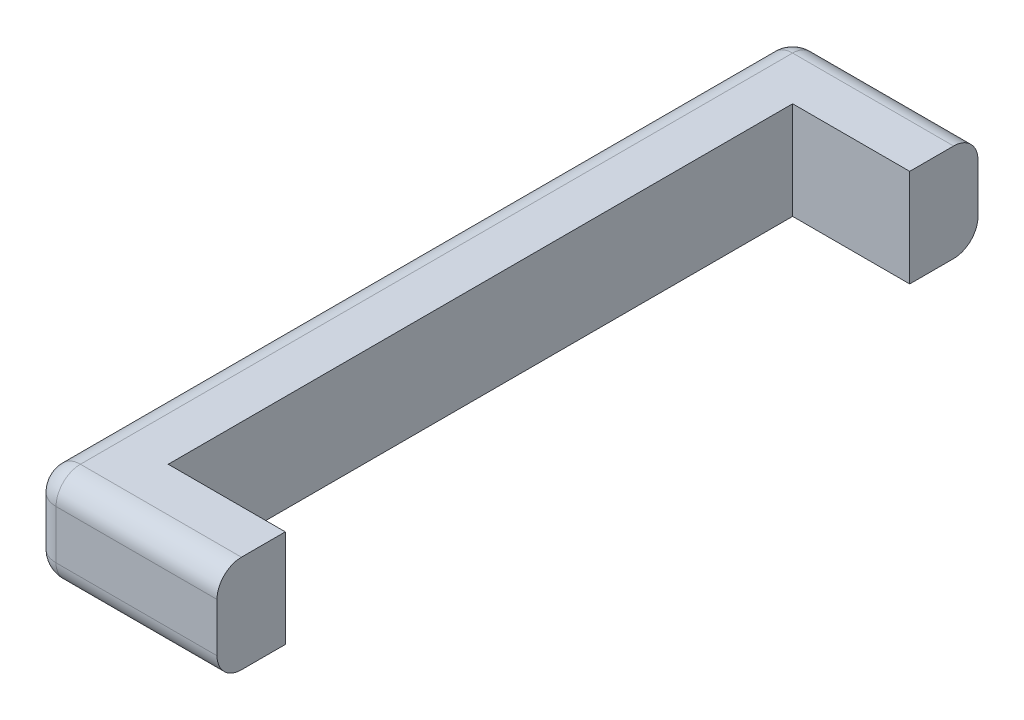
ISO-10303-21;
HEADER;
FILE_DESCRIPTION(('STEP AP214'),'2;1');
FILE_NAME('part.step','',(''),(''),'','','');
FILE_SCHEMA(('AUTOMOTIVE_DESIGN { 1 0 10303 214 1 1 1 1 }'));
ENDSEC;
DATA;
#1=APPLICATION_CONTEXT('core data for automotive mechanical design processes');
#2=APPLICATION_PROTOCOL_DEFINITION('international standard','automotive_design',2000,#1);
#3=PRODUCT_CONTEXT('',#1,'mechanical');
#4=PRODUCT('Part','Part','',(#3));
#5=PRODUCT_RELATED_PRODUCT_CATEGORY('part','',(#4));
#6=PRODUCT_DEFINITION_FORMATION('','',#4);
#7=PRODUCT_DEFINITION_CONTEXT('part definition',#1,'design');
#8=PRODUCT_DEFINITION('design','',#6,#7);
#9=PRODUCT_DEFINITION_SHAPE('','',#8);
#10=(LENGTH_UNIT() NAMED_UNIT(*) SI_UNIT(.MILLI.,.METRE.));
#11=(NAMED_UNIT(*) PLANE_ANGLE_UNIT() SI_UNIT($,.RADIAN.));
#12=(NAMED_UNIT(*) SI_UNIT($,.STERADIAN.) SOLID_ANGLE_UNIT());
#13=UNCERTAINTY_MEASURE_WITH_UNIT(LENGTH_MEASURE(1.E-05),#10,'distance_accuracy_value','');
#14=(GEOMETRIC_REPRESENTATION_CONTEXT(3) GLOBAL_UNCERTAINTY_ASSIGNED_CONTEXT((#13)) GLOBAL_UNIT_ASSIGNED_CONTEXT((#10,
#11,#12)) REPRESENTATION_CONTEXT('',''));
#15=CARTESIAN_POINT('',(0.,0.,0.));
#16=DIRECTION('',(0.,0.,1.));
#17=DIRECTION('',(1.,0.,0.));
#18=AXIS2_PLACEMENT_3D('',#15,#16,#17);
#19=CARTESIAN_POINT('',(1.2490009027033E-13,63.5,-495.3));
#20=DIRECTION('',(1.,0.,0.));
#21=DIRECTION('',(0.,0.,-1.));
#22=AXIS2_PLACEMENT_3D('',#19,#20,#21);
#23=PLANE('',#22);
#24=DIRECTION('',(0.,-1.,0.));
#25=VECTOR('',#24,1.);
#26=CARTESIAN_POINT('',(1.2490009027033E-13,63.5,-463.55));
#27=LINE('',#26,#25);
#28=CARTESIAN_POINT('',(1.2490009027033E-13,31.75,-463.55));
#29=VERTEX_POINT('',#28);
#30=CARTESIAN_POINT('',(1.2490009027033E-13,-31.75,-463.55));
#31=VERTEX_POINT('',#30);
#32=EDGE_CURVE('E196',#29,#31,#27,.T.);
#33=ORIENTED_EDGE('',*,*,#32,.T.);
#34=DIRECTION('',(0.,0.,1.));
#35=VECTOR('',#34,1.);
#36=CARTESIAN_POINT('',(1.2490009027033E-13,-31.75,-495.3));
#37=LINE('',#36,#35);
#38=CARTESIAN_POINT('',(1.2490009027033E-13,-31.75,463.55));
#39=VERTEX_POINT('',#38);
#40=EDGE_CURVE('E11',#31,#39,#37,.T.);
#41=ORIENTED_EDGE('',*,*,#40,.T.);
#42=DIRECTION('',(0.,-1.,0.));
#43=VECTOR('',#42,1.);
#44=CARTESIAN_POINT('',(1.2490009027033E-13,63.5,463.55));
#45=LINE('',#44,#43);
#46=CARTESIAN_POINT('',(1.2490009027033E-13,31.75,463.55));
#47=VERTEX_POINT('',#46);
#48=EDGE_CURVE('E193',#39,#47,#45,.F.);
#49=ORIENTED_EDGE('',*,*,#48,.T.);
#50=DIRECTION('',(0.,0.,1.));
#51=VECTOR('',#50,1.);
#52=CARTESIAN_POINT('',(1.2490009027033E-13,31.75,-463.55));
#53=LINE('',#52,#51);
#54=EDGE_CURVE('E44',#47,#29,#53,.F.);
#55=ORIENTED_EDGE('',*,*,#54,.T.);
#56=EDGE_LOOP('',(#33,#41,#49,#55));
#57=FACE_BOUND('',#56,.T.);
#58=ADVANCED_FACE('F35',(#57),#23,.F.);
#59=CARTESIAN_POINT('',(1.2490009027033E-13,63.5,495.3));
#60=DIRECTION('',(0.,0.,-1.));
#61=DIRECTION('',(-1.,0.,0.));
#62=AXIS2_PLACEMENT_3D('',#59,#60,#61);
#63=PLANE('',#62);
#64=DIRECTION('',(0.,-1.,0.));
#65=VECTOR('',#64,1.);
#66=CARTESIAN_POINT('',(31.7500000000001,63.5,495.3));
#67=LINE('',#66,#65);
#68=CARTESIAN_POINT('',(31.7500000000001,31.75,495.3));
#69=VERTEX_POINT('',#68);
#70=CARTESIAN_POINT('',(31.7500000000001,-31.75,495.3));
#71=VERTEX_POINT('',#70);
#72=EDGE_CURVE('E202',#69,#71,#67,.T.);
#73=ORIENTED_EDGE('',*,*,#72,.T.);
#74=DIRECTION('',(1.,0.,0.));
#75=VECTOR('',#74,1.);
#76=CARTESIAN_POINT('',(1.2490009027033E-13,-31.75,495.3));
#77=LINE('',#76,#75);
#78=CARTESIAN_POINT('',(241.3,-31.75,495.3));
#79=VERTEX_POINT('',#78);
#80=EDGE_CURVE('E226',#71,#79,#77,.T.);
#81=ORIENTED_EDGE('',*,*,#80,.T.);
#82=DIRECTION('',(0.,-1.,0.));
#83=VECTOR('',#82,1.);
#84=CARTESIAN_POINT('',(241.3,63.5,495.3));
#85=LINE('',#84,#83);
#86=CARTESIAN_POINT('',(241.3,31.75,495.3));
#87=VERTEX_POINT('',#86);
#88=EDGE_CURVE('E158',#87,#79,#85,.T.);
#89=ORIENTED_EDGE('',*,*,#88,.F.);
#90=DIRECTION('',(1.,0.,0.));
#91=VECTOR('',#90,1.);
#92=CARTESIAN_POINT('',(31.7500000000001,31.75,495.3));
#93=LINE('',#92,#91);
#94=EDGE_CURVE('E224',#87,#69,#93,.F.);
#95=ORIENTED_EDGE('',*,*,#94,.T.);
#96=EDGE_LOOP('',(#73,#81,#89,#95));
#97=FACE_BOUND('',#96,.T.);
#98=ADVANCED_FACE('F268',(#97),#63,.F.);
#99=CARTESIAN_POINT('',(241.3,63.5,406.4));
#100=DIRECTION('',(-1.,0.,0.));
#101=DIRECTION('',(0.,0.,1.));
#102=AXIS2_PLACEMENT_3D('',#99,#100,#101);
#103=PLANE('',#102);
#104=ORIENTED_EDGE('',*,*,#88,.T.);
#105=CARTESIAN_POINT('',(241.3,-31.75,463.55));
#106=DIRECTION('',(-1.,0.,0.));
#107=DIRECTION('',(0.,0.,1.));
#108=AXIS2_PLACEMENT_3D('',#105,#106,#107);
#109=CIRCLE('',#108,31.75);
#110=CARTESIAN_POINT('',(241.3,-63.5,463.55));
#111=VERTEX_POINT('',#110);
#112=EDGE_CURVE('E230',#79,#111,#109,.F.);
#113=ORIENTED_EDGE('',*,*,#112,.T.);
#114=DIRECTION('',(0.,0.,-1.));
#115=VECTOR('',#114,1.);
#116=CARTESIAN_POINT('',(241.3,-63.5,406.4));
#117=LINE('',#116,#115);
#118=CARTESIAN_POINT('',(241.3,-63.5,406.4));
#119=VERTEX_POINT('',#118);
#120=EDGE_CURVE('E155',#111,#119,#117,.T.);
#121=ORIENTED_EDGE('',*,*,#120,.T.);
#122=DIRECTION('',(0.,-1.,0.));
#123=VECTOR('',#122,1.);
#124=CARTESIAN_POINT('',(241.3,63.5,406.4));
#125=LINE('',#124,#123);
#126=CARTESIAN_POINT('',(241.3,63.5,406.4));
#127=VERTEX_POINT('',#126);
#128=EDGE_CURVE('E151',#127,#119,#125,.T.);
#129=ORIENTED_EDGE('',*,*,#128,.F.);
#130=DIRECTION('',(0.,0.,-1.));
#131=VECTOR('',#130,1.);
#132=CARTESIAN_POINT('',(241.3,63.5,406.4));
#133=LINE('',#132,#131);
#134=CARTESIAN_POINT('',(241.3,63.5,463.55));
#135=VERTEX_POINT('',#134);
#136=EDGE_CURVE('E138',#135,#127,#133,.T.);
#137=ORIENTED_EDGE('',*,*,#136,.F.);
#138=CARTESIAN_POINT('',(241.3,31.75,463.55));
#139=DIRECTION('',(-1.,0.,0.));
#140=DIRECTION('',(0.,0.,1.));
#141=AXIS2_PLACEMENT_3D('',#138,#139,#140);
#142=CIRCLE('',#141,31.75);
#143=EDGE_CURVE('E228',#135,#87,#142,.F.);
#144=ORIENTED_EDGE('',*,*,#143,.T.);
#145=EDGE_LOOP('',(#104,#113,#121,#129,#137,#144));
#146=FACE_BOUND('',#145,.T.);
#147=ADVANCED_FACE('F153',(#146),#103,.F.);
#148=CARTESIAN_POINT('',(241.3,63.5,406.4));
#149=DIRECTION('',(0.,0.,1.));
#150=DIRECTION('',(1.,0.,0.));
#151=AXIS2_PLACEMENT_3D('',#148,#149,#150);
#152=PLANE('',#151);
#153=DIRECTION('',(-1.,0.,0.));
#154=VECTOR('',#153,1.);
#155=CARTESIAN_POINT('',(241.3,-63.5,406.4));
#156=LINE('',#155,#154);
#157=CARTESIAN_POINT('',(88.9000000000001,-63.5,406.4));
#158=VERTEX_POINT('',#157);
#159=EDGE_CURVE('E174',#119,#158,#156,.T.);
#160=ORIENTED_EDGE('',*,*,#159,.T.);
#161=DIRECTION('',(0.,-1.,0.));
#162=VECTOR('',#161,1.);
#163=CARTESIAN_POINT('',(88.9000000000001,63.5,406.4));
#164=LINE('',#163,#162);
#165=CARTESIAN_POINT('',(88.9000000000001,63.5,406.4));
#166=VERTEX_POINT('',#165);
#167=EDGE_CURVE('E159',#166,#158,#164,.T.);
#168=ORIENTED_EDGE('',*,*,#167,.F.);
#169=DIRECTION('',(-1.,0.,0.));
#170=VECTOR('',#169,1.);
#171=CARTESIAN_POINT('',(241.3,63.5,406.4));
#172=LINE('',#171,#170);
#173=EDGE_CURVE('E143',#127,#166,#172,.T.);
#174=ORIENTED_EDGE('',*,*,#173,.F.);
#175=ORIENTED_EDGE('',*,*,#128,.T.);
#176=EDGE_LOOP('',(#160,#168,#174,#175));
#177=FACE_BOUND('',#176,.T.);
#178=ADVANCED_FACE('F161',(#177),#152,.F.);
#179=CARTESIAN_POINT('',(88.9000000000001,63.5,-406.4));
#180=DIRECTION('',(-1.,0.,0.));
#181=DIRECTION('',(0.,0.,1.));
#182=AXIS2_PLACEMENT_3D('',#179,#180,#181);
#183=PLANE('',#182);
#184=DIRECTION('',(0.,0.,-1.));
#185=VECTOR('',#184,1.);
#186=CARTESIAN_POINT('',(88.9000000000001,-63.5,-406.4));
#187=LINE('',#186,#185);
#188=CARTESIAN_POINT('',(88.9000000000001,-63.5,-406.4));
#189=VERTEX_POINT('',#188);
#190=EDGE_CURVE('E177',#158,#189,#187,.T.);
#191=ORIENTED_EDGE('',*,*,#190,.T.);
#192=DIRECTION('',(0.,-1.,0.));
#193=VECTOR('',#192,1.);
#194=CARTESIAN_POINT('',(88.9000000000001,63.5,-406.4));
#195=LINE('',#194,#193);
#196=CARTESIAN_POINT('',(88.9000000000001,63.5,-406.4));
#197=VERTEX_POINT('',#196);
#198=EDGE_CURVE('E188',#197,#189,#195,.T.);
#199=ORIENTED_EDGE('',*,*,#198,.F.);
#200=DIRECTION('',(0.,0.,-1.));
#201=VECTOR('',#200,1.);
#202=CARTESIAN_POINT('',(88.9000000000001,63.5,-406.4));
#203=LINE('',#202,#201);
#204=EDGE_CURVE('E164',#166,#197,#203,.T.);
#205=ORIENTED_EDGE('',*,*,#204,.F.);
#206=ORIENTED_EDGE('',*,*,#167,.T.);
#207=EDGE_LOOP('',(#191,#199,#205,#206));
#208=FACE_BOUND('',#207,.T.);
#209=ADVANCED_FACE('F291',(#208),#183,.F.);
#210=CARTESIAN_POINT('',(241.3,63.5,-406.4));
#211=DIRECTION('',(0.,0.,-1.));
#212=DIRECTION('',(-1.,0.,0.));
#213=AXIS2_PLACEMENT_3D('',#210,#211,#212);
#214=PLANE('',#213);
#215=DIRECTION('',(1.,0.,0.));
#216=VECTOR('',#215,1.);
#217=CARTESIAN_POINT('',(241.3,-63.5,-406.4));
#218=LINE('',#217,#216);
#219=CARTESIAN_POINT('',(241.3,-63.5,-406.4));
#220=VERTEX_POINT('',#219);
#221=EDGE_CURVE('E179',#189,#220,#218,.T.);
#222=ORIENTED_EDGE('',*,*,#221,.T.);
#223=DIRECTION('',(0.,-1.,0.));
#224=VECTOR('',#223,1.);
#225=CARTESIAN_POINT('',(241.3,63.5,-406.4));
#226=LINE('',#225,#224);
#227=CARTESIAN_POINT('',(241.3,63.5,-406.4));
#228=VERTEX_POINT('',#227);
#229=EDGE_CURVE('E185',#228,#220,#226,.T.);
#230=ORIENTED_EDGE('',*,*,#229,.F.);
#231=DIRECTION('',(1.,0.,0.));
#232=VECTOR('',#231,1.);
#233=CARTESIAN_POINT('',(241.3,63.5,-406.4));
#234=LINE('',#233,#232);
#235=EDGE_CURVE('E166',#197,#228,#234,.T.);
#236=ORIENTED_EDGE('',*,*,#235,.F.);
#237=ORIENTED_EDGE('',*,*,#198,.T.);
#238=EDGE_LOOP('',(#222,#230,#236,#237));
#239=FACE_BOUND('',#238,.T.);
#240=ADVANCED_FACE('F297',(#239),#214,.F.);
#241=CARTESIAN_POINT('',(241.3,63.5,-495.3));
#242=DIRECTION('',(-1.,0.,0.));
#243=DIRECTION('',(0.,0.,1.));
#244=AXIS2_PLACEMENT_3D('',#241,#242,#243);
#245=PLANE('',#244);
#246=DIRECTION('',(0.,0.,-1.));
#247=VECTOR('',#246,1.);
#248=CARTESIAN_POINT('',(241.3,-63.5,-495.3));
#249=LINE('',#248,#247);
#250=CARTESIAN_POINT('',(241.3,-63.5,-463.55));
#251=VERTEX_POINT('',#250);
#252=EDGE_CURVE('E148',#220,#251,#249,.T.);
#253=ORIENTED_EDGE('',*,*,#252,.T.);
#254=CARTESIAN_POINT('',(241.3,-31.75,-463.55));
#255=DIRECTION('',(-1.,0.,0.));
#256=DIRECTION('',(0.,0.,1.));
#257=AXIS2_PLACEMENT_3D('',#254,#255,#256);
#258=CIRCLE('',#257,31.75);
#259=CARTESIAN_POINT('',(241.3,-31.75,-495.3));
#260=VERTEX_POINT('',#259);
#261=EDGE_CURVE('E218',#251,#260,#258,.F.);
#262=ORIENTED_EDGE('',*,*,#261,.T.);
#263=DIRECTION('',(0.,-1.,0.));
#264=VECTOR('',#263,1.);
#265=CARTESIAN_POINT('',(241.3,63.5,-495.3));
#266=LINE('',#265,#264);
#267=CARTESIAN_POINT('',(241.3,31.75,-495.3));
#268=VERTEX_POINT('',#267);
#269=EDGE_CURVE('E172',#268,#260,#266,.T.);
#270=ORIENTED_EDGE('',*,*,#269,.F.);
#271=CARTESIAN_POINT('',(241.3,31.75,-463.55));
#272=DIRECTION('',(-1.,0.,0.));
#273=DIRECTION('',(0.,0.,1.));
#274=AXIS2_PLACEMENT_3D('',#271,#272,#273);
#275=CIRCLE('',#274,31.75);
#276=CARTESIAN_POINT('',(241.3,63.5,-463.55));
#277=VERTEX_POINT('',#276);
#278=EDGE_CURVE('E216',#268,#277,#275,.F.);
#279=ORIENTED_EDGE('',*,*,#278,.T.);
#280=DIRECTION('',(0.,0.,-1.));
#281=VECTOR('',#280,1.);
#282=CARTESIAN_POINT('',(241.3,63.5,-495.3));
#283=LINE('',#282,#281);
#284=EDGE_CURVE('E170',#228,#277,#283,.T.);
#285=ORIENTED_EDGE('',*,*,#284,.F.);
#286=ORIENTED_EDGE('',*,*,#229,.T.);
#287=EDGE_LOOP('',(#253,#262,#270,#279,#285,#286));
#288=FACE_BOUND('',#287,.T.);
#289=ADVANCED_FACE('F299',(#288),#245,.F.);
#290=CARTESIAN_POINT('',(1.2490009027033E-13,63.5,-495.3));
#291=DIRECTION('',(0.,0.,1.));
#292=DIRECTION('',(1.,0.,0.));
#293=AXIS2_PLACEMENT_3D('',#290,#291,#292);
#294=PLANE('',#293);
#295=ORIENTED_EDGE('',*,*,#269,.T.);
#296=DIRECTION('',(-1.,0.,0.));
#297=VECTOR('',#296,1.);
#298=CARTESIAN_POINT('',(1.2490009027033E-13,-31.75,-495.3));
#299=LINE('',#298,#297);
#300=CARTESIAN_POINT('',(31.7500000000001,-31.75,-495.3));
#301=VERTEX_POINT('',#300);
#302=EDGE_CURVE('E207',#260,#301,#299,.T.);
#303=ORIENTED_EDGE('',*,*,#302,.T.);
#304=DIRECTION('',(0.,-1.,0.));
#305=VECTOR('',#304,1.);
#306=CARTESIAN_POINT('',(31.7500000000001,63.5,-495.3));
#307=LINE('',#306,#305);
#308=CARTESIAN_POINT('',(31.7500000000001,31.75,-495.3));
#309=VERTEX_POINT('',#308);
#310=EDGE_CURVE('E199',#301,#309,#307,.F.);
#311=ORIENTED_EDGE('',*,*,#310,.T.);
#312=DIRECTION('',(-1.,0.,0.));
#313=VECTOR('',#312,1.);
#314=CARTESIAN_POINT('',(241.3,31.75,-495.3));
#315=LINE('',#314,#313);
#316=EDGE_CURVE('E205',#309,#268,#315,.F.);
#317=ORIENTED_EDGE('',*,*,#316,.T.);
#318=EDGE_LOOP('',(#295,#303,#311,#317));
#319=FACE_BOUND('',#318,.T.);
#320=ADVANCED_FACE('F434',(#319),#294,.F.);
#321=CARTESIAN_POINT('',(0.,63.5,0.));
#322=DIRECTION('',(0.,1.,0.));
#323=DIRECTION('',(0.,0.,1.));
#324=AXIS2_PLACEMENT_3D('',#321,#322,#323);
#325=PLANE('',#324);
#326=ORIENTED_EDGE('',*,*,#284,.T.);
#327=DIRECTION('',(-1.,0.,0.));
#328=VECTOR('',#327,1.);
#329=CARTESIAN_POINT('',(31.7500000000001,63.5,-463.55));
#330=LINE('',#329,#328);
#331=CARTESIAN_POINT('',(31.7500000000001,63.5,-463.55));
#332=VERTEX_POINT('',#331);
#333=EDGE_CURVE('E238',#277,#332,#330,.T.);
#334=ORIENTED_EDGE('',*,*,#333,.T.);
#335=DIRECTION('',(0.,0.,1.));
#336=VECTOR('',#335,1.);
#337=CARTESIAN_POINT('',(31.7500000000001,63.5,463.55));
#338=LINE('',#337,#336);
#339=CARTESIAN_POINT('',(31.7500000000001,63.5,463.55));
#340=VERTEX_POINT('',#339);
#341=EDGE_CURVE('E52',#332,#340,#338,.T.);
#342=ORIENTED_EDGE('',*,*,#341,.T.);
#343=DIRECTION('',(1.,0.,0.));
#344=VECTOR('',#343,1.);
#345=CARTESIAN_POINT('',(241.3,63.5,463.55));
#346=LINE('',#345,#344);
#347=EDGE_CURVE('E145',#340,#135,#346,.T.);
#348=ORIENTED_EDGE('',*,*,#347,.T.);
#349=ORIENTED_EDGE('',*,*,#136,.T.);
#350=ORIENTED_EDGE('',*,*,#173,.T.);
#351=ORIENTED_EDGE('',*,*,#204,.T.);
#352=ORIENTED_EDGE('',*,*,#235,.T.);
#353=EDGE_LOOP('',(#326,#334,#342,#348,#349,#350,#351,#352));
#354=FACE_BOUND('',#353,.T.);
#355=ADVANCED_FACE('F141',(#354),#325,.T.);
#356=CARTESIAN_POINT('',(0.,-63.5,0.));
#357=DIRECTION('',(0.,1.,0.));
#358=DIRECTION('',(0.,0.,1.));
#359=AXIS2_PLACEMENT_3D('',#356,#357,#358);
#360=PLANE('',#359);
#361=DIRECTION('',(0.,0.,1.));
#362=VECTOR('',#361,1.);
#363=CARTESIAN_POINT('',(31.7500000000001,-63.5,0.));
#364=LINE('',#363,#362);
#365=CARTESIAN_POINT('',(31.7500000000001,-63.5,463.55));
#366=VERTEX_POINT('',#365);
#367=CARTESIAN_POINT('',(31.7500000000001,-63.5,-463.55));
#368=VERTEX_POINT('',#367);
#369=EDGE_CURVE('E210',#366,#368,#364,.F.);
#370=ORIENTED_EDGE('',*,*,#369,.T.);
#371=DIRECTION('',(-1.,0.,0.));
#372=VECTOR('',#371,1.);
#373=CARTESIAN_POINT('',(-1.06639843154785E-13,-63.5,-463.55));
#374=LINE('',#373,#372);
#375=EDGE_CURVE('E214',#368,#251,#374,.F.);
#376=ORIENTED_EDGE('',*,*,#375,.T.);
#377=ORIENTED_EDGE('',*,*,#252,.F.);
#378=ORIENTED_EDGE('',*,*,#221,.F.);
#379=ORIENTED_EDGE('',*,*,#190,.F.);
#380=ORIENTED_EDGE('',*,*,#159,.F.);
#381=ORIENTED_EDGE('',*,*,#120,.F.);
#382=DIRECTION('',(1.,0.,0.));
#383=VECTOR('',#382,1.);
#384=CARTESIAN_POINT('',(-1.06639843154785E-13,-63.5,463.55));
#385=LINE('',#384,#383);
#386=EDGE_CURVE('E212',#111,#366,#385,.F.);
#387=ORIENTED_EDGE('',*,*,#386,.T.);
#388=EDGE_LOOP('',(#370,#376,#377,#378,#379,#380,#381,#387));
#389=FACE_BOUND('',#388,.T.);
#390=ADVANCED_FACE('F286',(#389),#360,.F.);
#391=CARTESIAN_POINT('',(31.7500000000001,63.5,-463.55));
#392=DIRECTION('',(0.,-1.,0.));
#393=DIRECTION('',(0.,0.,-1.));
#394=AXIS2_PLACEMENT_3D('',#391,#392,#393);
#395=CYLINDRICAL_SURFACE('',#394,31.75);
#396=ORIENTED_EDGE('',*,*,#310,.F.);
#397=CARTESIAN_POINT('',(31.7500000000001,-31.75,-463.55));
#398=DIRECTION('',(0.,-1.,0.));
#399=DIRECTION('',(0.,0.,-1.));
#400=AXIS2_PLACEMENT_3D('',#397,#398,#399);
#401=CIRCLE('',#400,31.75);
#402=EDGE_CURVE('E222',#301,#31,#401,.F.);
#403=ORIENTED_EDGE('',*,*,#402,.T.);
#404=ORIENTED_EDGE('',*,*,#32,.F.);
#405=CARTESIAN_POINT('',(31.7500000000001,31.75,-463.55));
#406=DIRECTION('',(0.,-1.,0.));
#407=DIRECTION('',(0.,0.,-1.));
#408=AXIS2_PLACEMENT_3D('',#405,#406,#407);
#409=CIRCLE('',#408,31.75);
#410=EDGE_CURVE('E220',#29,#309,#409,.T.);
#411=ORIENTED_EDGE('',*,*,#410,.T.);
#412=EDGE_LOOP('',(#396,#403,#404,#411));
#413=FACE_BOUND('',#412,.T.);
#414=ADVANCED_FACE('F325',(#413),#395,.T.);
#415=CARTESIAN_POINT('',(31.7500000000001,63.5,463.55));
#416=DIRECTION('',(0.,-1.,0.));
#417=DIRECTION('',(0.,0.,-1.));
#418=AXIS2_PLACEMENT_3D('',#415,#416,#417);
#419=CYLINDRICAL_SURFACE('',#418,31.75);
#420=ORIENTED_EDGE('',*,*,#48,.F.);
#421=CARTESIAN_POINT('',(31.7500000000001,-31.75,463.55));
#422=DIRECTION('',(0.,-1.,0.));
#423=DIRECTION('',(0.,0.,-1.));
#424=AXIS2_PLACEMENT_3D('',#421,#422,#423);
#425=CIRCLE('',#424,31.75);
#426=EDGE_CURVE('E234',#39,#71,#425,.F.);
#427=ORIENTED_EDGE('',*,*,#426,.T.);
#428=ORIENTED_EDGE('',*,*,#72,.F.);
#429=CARTESIAN_POINT('',(31.7500000000001,31.75,463.55));
#430=DIRECTION('',(0.,-1.,0.));
#431=DIRECTION('',(0.,0.,-1.));
#432=AXIS2_PLACEMENT_3D('',#429,#430,#431);
#433=CIRCLE('',#432,31.75);
#434=EDGE_CURVE('E232',#69,#47,#433,.T.);
#435=ORIENTED_EDGE('',*,*,#434,.T.);
#436=EDGE_LOOP('',(#420,#427,#428,#435));
#437=FACE_BOUND('',#436,.T.);
#438=ADVANCED_FACE('F328',(#437),#419,.T.);
#439=CARTESIAN_POINT('',(1.32204189116548E-13,-31.75,463.55));
#440=DIRECTION('',(1.,0.,0.));
#441=DIRECTION('',(0.,0.,-1.));
#442=AXIS2_PLACEMENT_3D('',#439,#440,#441);
#443=CYLINDRICAL_SURFACE('',#442,31.75);
#444=ORIENTED_EDGE('',*,*,#112,.F.);
#445=ORIENTED_EDGE('',*,*,#80,.F.);
#446=CARTESIAN_POINT('',(31.7500000000001,-31.75,463.55));
#447=DIRECTION('',(-1.,0.,0.));
#448=DIRECTION('',(0.,0.,1.));
#449=AXIS2_PLACEMENT_3D('',#446,#447,#448);
#450=CIRCLE('',#449,31.75);
#451=EDGE_CURVE('E175',#366,#71,#450,.T.);
#452=ORIENTED_EDGE('',*,*,#451,.F.);
#453=ORIENTED_EDGE('',*,*,#386,.F.);
#454=EDGE_LOOP('',(#444,#445,#452,#453));
#455=FACE_BOUND('',#454,.T.);
#456=ADVANCED_FACE('F273',(#455),#443,.T.);
#457=CARTESIAN_POINT('',(31.7500000000001,-31.75,463.55));
#458=DIRECTION('',(0.,1.,0.));
#459=DIRECTION('',(0.,0.,1.));
#460=AXIS2_PLACEMENT_3D('',#457,#458,#459);
#461=SPHERICAL_SURFACE('',#460,31.75);
#462=ORIENTED_EDGE('',*,*,#451,.T.);
#463=ORIENTED_EDGE('',*,*,#426,.F.);
#464=CARTESIAN_POINT('',(31.7500000000001,-31.75,463.55));
#465=DIRECTION('',(0.,0.,-1.));
#466=DIRECTION('',(-1.,0.,0.));
#467=AXIS2_PLACEMENT_3D('',#464,#465,#466);
#468=CIRCLE('',#467,31.75);
#469=EDGE_CURVE('E246',#366,#39,#468,.T.);
#470=ORIENTED_EDGE('',*,*,#469,.F.);
#471=EDGE_LOOP('',(#462,#463,#470));
#472=FACE_BOUND('',#471,.T.);
#473=ADVANCED_FACE('F278',(#472),#461,.T.);
#474=CARTESIAN_POINT('',(31.7500000000001,-31.75,-495.3));
#475=DIRECTION('',(0.,0.,1.));
#476=DIRECTION('',(1.,0.,0.));
#477=AXIS2_PLACEMENT_3D('',#474,#475,#476);
#478=CYLINDRICAL_SURFACE('',#477,31.75);
#479=ORIENTED_EDGE('',*,*,#469,.T.);
#480=ORIENTED_EDGE('',*,*,#40,.F.);
#481=CARTESIAN_POINT('',(31.7500000000001,-31.75,-463.55));
#482=DIRECTION('',(0.,0.,-1.));
#483=DIRECTION('',(-1.,0.,0.));
#484=AXIS2_PLACEMENT_3D('',#481,#482,#483);
#485=CIRCLE('',#484,31.75);
#486=EDGE_CURVE('E243',#368,#31,#485,.T.);
#487=ORIENTED_EDGE('',*,*,#486,.F.);
#488=ORIENTED_EDGE('',*,*,#369,.F.);
#489=EDGE_LOOP('',(#479,#480,#487,#488));
#490=FACE_BOUND('',#489,.T.);
#491=ADVANCED_FACE('F283',(#490),#478,.T.);
#492=CARTESIAN_POINT('',(31.7500000000001,-31.75,-463.55));
#493=DIRECTION('',(0.,1.,0.));
#494=DIRECTION('',(0.,0.,1.));
#495=AXIS2_PLACEMENT_3D('',#492,#493,#494);
#496=SPHERICAL_SURFACE('',#495,31.75);
#497=ORIENTED_EDGE('',*,*,#486,.T.);
#498=ORIENTED_EDGE('',*,*,#402,.F.);
#499=CARTESIAN_POINT('',(31.7500000000001,-31.75,-463.55));
#500=DIRECTION('',(1.,0.,0.));
#501=DIRECTION('',(0.,0.,-1.));
#502=AXIS2_PLACEMENT_3D('',#499,#500,#501);
#503=CIRCLE('',#502,31.75);
#504=EDGE_CURVE('E241',#368,#301,#503,.T.);
#505=ORIENTED_EDGE('',*,*,#504,.F.);
#506=EDGE_LOOP('',(#497,#498,#505));
#507=FACE_BOUND('',#506,.T.);
#508=ADVANCED_FACE('F336',(#507),#496,.T.);
#509=CARTESIAN_POINT('',(1.32204189116548E-13,-31.75,-463.55));
#510=DIRECTION('',(-1.,0.,0.));
#511=DIRECTION('',(0.,0.,1.));
#512=AXIS2_PLACEMENT_3D('',#509,#510,#511);
#513=CYLINDRICAL_SURFACE('',#512,31.75);
#514=ORIENTED_EDGE('',*,*,#261,.F.);
#515=ORIENTED_EDGE('',*,*,#375,.F.);
#516=ORIENTED_EDGE('',*,*,#504,.T.);
#517=ORIENTED_EDGE('',*,*,#302,.F.);
#518=EDGE_LOOP('',(#514,#515,#516,#517));
#519=FACE_BOUND('',#518,.T.);
#520=ADVANCED_FACE('F333',(#519),#513,.T.);
#521=CARTESIAN_POINT('',(-1.06639843154785E-13,31.75,463.55));
#522=DIRECTION('',(-1.,0.,0.));
#523=DIRECTION('',(0.,0.,1.));
#524=AXIS2_PLACEMENT_3D('',#521,#522,#523);
#525=CYLINDRICAL_SURFACE('',#524,31.75);
#526=CARTESIAN_POINT('',(31.7500000000001,31.75,463.55));
#527=DIRECTION('',(-1.,0.,0.));
#528=DIRECTION('',(0.,0.,1.));
#529=AXIS2_PLACEMENT_3D('',#526,#527,#528);
#530=CIRCLE('',#529,31.75);
#531=EDGE_CURVE('E39',#69,#340,#530,.T.);
#532=ORIENTED_EDGE('',*,*,#531,.F.);
#533=ORIENTED_EDGE('',*,*,#94,.F.);
#534=ORIENTED_EDGE('',*,*,#143,.F.);
#535=ORIENTED_EDGE('',*,*,#347,.F.);
#536=EDGE_LOOP('',(#532,#533,#534,#535));
#537=FACE_BOUND('',#536,.T.);
#538=ADVANCED_FACE('F37',(#537),#525,.T.);
#539=CARTESIAN_POINT('',(31.7500000000001,31.75,463.55));
#540=DIRECTION('',(0.,1.,0.));
#541=DIRECTION('',(0.,0.,1.));
#542=AXIS2_PLACEMENT_3D('',#539,#540,#541);
#543=SPHERICAL_SURFACE('',#542,31.75);
#544=ORIENTED_EDGE('',*,*,#434,.F.);
#545=ORIENTED_EDGE('',*,*,#531,.T.);
#546=CARTESIAN_POINT('',(31.7500000000001,31.75,463.55));
#547=DIRECTION('',(0.,0.,-1.));
#548=DIRECTION('',(-1.,0.,0.));
#549=AXIS2_PLACEMENT_3D('',#546,#547,#548);
#550=CIRCLE('',#549,31.75);
#551=EDGE_CURVE('E253',#47,#340,#550,.T.);
#552=ORIENTED_EDGE('',*,*,#551,.F.);
#553=EDGE_LOOP('',(#544,#545,#552));
#554=FACE_BOUND('',#553,.T.);
#555=ADVANCED_FACE('F262',(#554),#543,.T.);
#556=CARTESIAN_POINT('',(31.7500000000001,31.75,0.));
#557=DIRECTION('',(0.,0.,-1.));
#558=DIRECTION('',(-1.,0.,0.));
#559=AXIS2_PLACEMENT_3D('',#556,#557,#558);
#560=CYLINDRICAL_SURFACE('',#559,31.75);
#561=CARTESIAN_POINT('',(31.7500000000001,31.75,-463.55));
#562=DIRECTION('',(0.,0.,-1.));
#563=DIRECTION('',(-1.,0.,0.));
#564=AXIS2_PLACEMENT_3D('',#561,#562,#563);
#565=CIRCLE('',#564,31.75);
#566=EDGE_CURVE('E252',#29,#332,#565,.T.);
#567=ORIENTED_EDGE('',*,*,#566,.F.);
#568=ORIENTED_EDGE('',*,*,#54,.F.);
#569=ORIENTED_EDGE('',*,*,#551,.T.);
#570=ORIENTED_EDGE('',*,*,#341,.F.);
#571=EDGE_LOOP('',(#567,#568,#569,#570));
#572=FACE_BOUND('',#571,.T.);
#573=ADVANCED_FACE('F308',(#572),#560,.T.);
#574=CARTESIAN_POINT('',(31.7500000000001,31.75,-463.55));
#575=DIRECTION('',(0.,1.,0.));
#576=DIRECTION('',(0.,0.,1.));
#577=AXIS2_PLACEMENT_3D('',#574,#575,#576);
#578=SPHERICAL_SURFACE('',#577,31.75);
#579=ORIENTED_EDGE('',*,*,#410,.F.);
#580=ORIENTED_EDGE('',*,*,#566,.T.);
#581=CARTESIAN_POINT('',(31.7500000000001,31.75,-463.55));
#582=DIRECTION('',(1.,0.,0.));
#583=DIRECTION('',(0.,0.,-1.));
#584=AXIS2_PLACEMENT_3D('',#581,#582,#583);
#585=CIRCLE('',#584,31.75);
#586=EDGE_CURVE('E60',#309,#332,#585,.T.);
#587=ORIENTED_EDGE('',*,*,#586,.F.);
#588=EDGE_LOOP('',(#579,#580,#587));
#589=FACE_BOUND('',#588,.T.);
#590=ADVANCED_FACE('F306',(#589),#578,.T.);
#591=CARTESIAN_POINT('',(-1.06639843154785E-13,31.75,-463.55));
#592=DIRECTION('',(1.,0.,0.));
#593=DIRECTION('',(0.,0.,-1.));
#594=AXIS2_PLACEMENT_3D('',#591,#592,#593);
#595=CYLINDRICAL_SURFACE('',#594,31.75);
#596=ORIENTED_EDGE('',*,*,#278,.F.);
#597=ORIENTED_EDGE('',*,*,#316,.F.);
#598=ORIENTED_EDGE('',*,*,#586,.T.);
#599=ORIENTED_EDGE('',*,*,#333,.F.);
#600=EDGE_LOOP('',(#596,#597,#598,#599));
#601=FACE_BOUND('',#600,.T.);
#602=ADVANCED_FACE('F302',(#601),#595,.T.);
#603=CLOSED_SHELL('',(#58,#98,#147,#178,#209,#240,#289,#320,#355,#390,#414,#438,#456,#473,#491,
#508,#520,#538,#555,#573,#590,#602));
#604=MANIFOLD_SOLID_BREP('B2',#603);
#605=ADVANCED_BREP_SHAPE_REPRESENTATION('',(#18,#604),#14);
#606=SHAPE_DEFINITION_REPRESENTATION(#9,#605);
ENDSEC;
END-ISO-10303-21;
